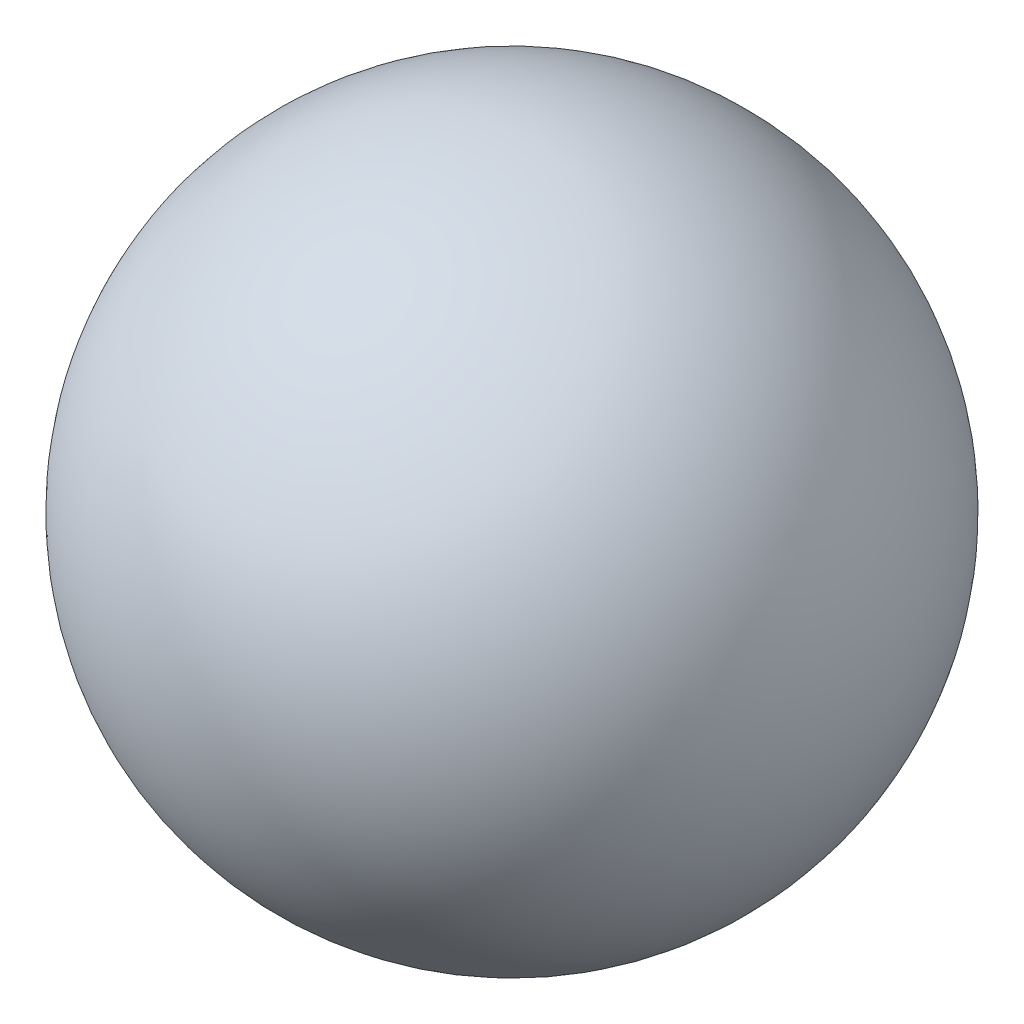
ISO-10303-21;
HEADER;
FILE_DESCRIPTION(('STEP AP214'),'2;1');
FILE_NAME('part.step','',(''),(''),'','','');
FILE_SCHEMA(('AUTOMOTIVE_DESIGN { 1 0 10303 214 1 1 1 1 }'));
ENDSEC;
DATA;
#1=APPLICATION_CONTEXT('core data for automotive mechanical design processes');
#2=APPLICATION_PROTOCOL_DEFINITION('international standard','automotive_design',2000,#1);
#3=PRODUCT_CONTEXT('',#1,'mechanical');
#4=PRODUCT('Part','Part','',(#3));
#5=PRODUCT_RELATED_PRODUCT_CATEGORY('part','',(#4));
#6=PRODUCT_DEFINITION_FORMATION('','',#4);
#7=PRODUCT_DEFINITION_CONTEXT('part definition',#1,'design');
#8=PRODUCT_DEFINITION('design','',#6,#7);
#9=PRODUCT_DEFINITION_SHAPE('','',#8);
#10=(LENGTH_UNIT() NAMED_UNIT(*) SI_UNIT(.MILLI.,.METRE.));
#11=(NAMED_UNIT(*) PLANE_ANGLE_UNIT() SI_UNIT($,.RADIAN.));
#12=(NAMED_UNIT(*) SI_UNIT($,.STERADIAN.) SOLID_ANGLE_UNIT());
#13=UNCERTAINTY_MEASURE_WITH_UNIT(LENGTH_MEASURE(1.E-05),#10,'distance_accuracy_value','');
#14=(GEOMETRIC_REPRESENTATION_CONTEXT(3) GLOBAL_UNCERTAINTY_ASSIGNED_CONTEXT((#13)) GLOBAL_UNIT_ASSIGNED_CONTEXT((#10,
#11,#12)) REPRESENTATION_CONTEXT('',''));
#15=CARTESIAN_POINT('',(0.,0.,0.));
#16=DIRECTION('',(0.,0.,1.));
#17=DIRECTION('',(1.,0.,0.));
#18=AXIS2_PLACEMENT_3D('',#15,#16,#17);
#19=CARTESIAN_POINT('',(0.,0.,0.));
#20=DIRECTION('',(-1.,0.,0.));
#21=DIRECTION('',(0.,1.,0.));
#22=AXIS2_PLACEMENT_3D('',#19,#20,#21);
#23=SPHERICAL_SURFACE('',#22,6.275);
#24=CARTESIAN_POINT('',(-6.275,0.,0.));
#25=VERTEX_POINT('',#24);
#26=VERTEX_LOOP('',#25);
#27=FACE_BOUND('',#26,.T.);
#28=ADVANCED_FACE('F30',(#27),#23,.T.);
#29=CLOSED_SHELL('',(#28));
#30=MANIFOLD_SOLID_BREP('B2',#29);
#31=ADVANCED_BREP_SHAPE_REPRESENTATION('',(#18,#30),#14);
#32=SHAPE_DEFINITION_REPRESENTATION(#9,#31);
ENDSEC;
END-ISO-10303-21;
